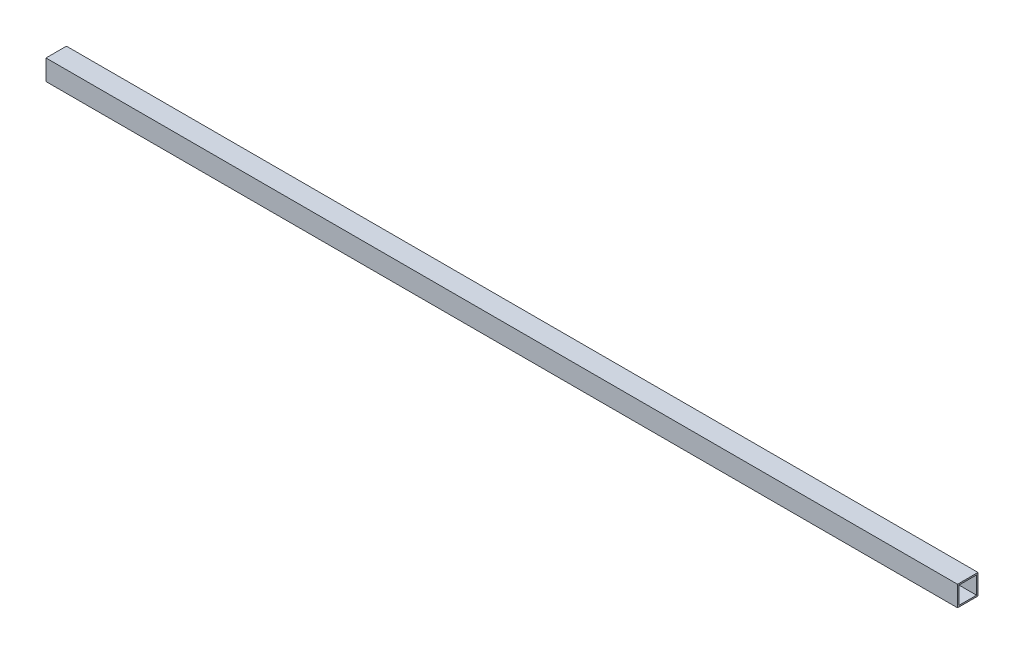
ISO-10303-21;
HEADER;
FILE_DESCRIPTION(('STEP AP214'),'2;1');
FILE_NAME('part.step','',(''),(''),'','','');
FILE_SCHEMA(('AUTOMOTIVE_DESIGN { 1 0 10303 214 1 1 1 1 }'));
ENDSEC;
DATA;
#1=APPLICATION_CONTEXT('core data for automotive mechanical design processes');
#2=APPLICATION_PROTOCOL_DEFINITION('international standard','automotive_design',2000,#1);
#3=PRODUCT_CONTEXT('',#1,'mechanical');
#4=PRODUCT('Part','Part','',(#3));
#5=PRODUCT_RELATED_PRODUCT_CATEGORY('part','',(#4));
#6=PRODUCT_DEFINITION_FORMATION('','',#4);
#7=PRODUCT_DEFINITION_CONTEXT('part definition',#1,'design');
#8=PRODUCT_DEFINITION('design','',#6,#7);
#9=PRODUCT_DEFINITION_SHAPE('','',#8);
#10=(LENGTH_UNIT() NAMED_UNIT(*) SI_UNIT(.MILLI.,.METRE.));
#11=(NAMED_UNIT(*) PLANE_ANGLE_UNIT() SI_UNIT($,.RADIAN.));
#12=(NAMED_UNIT(*) SI_UNIT($,.STERADIAN.) SOLID_ANGLE_UNIT());
#13=UNCERTAINTY_MEASURE_WITH_UNIT(LENGTH_MEASURE(1.E-05),#10,'distance_accuracy_value','');
#14=(GEOMETRIC_REPRESENTATION_CONTEXT(3) GLOBAL_UNCERTAINTY_ASSIGNED_CONTEXT((#13)) GLOBAL_UNIT_ASSIGNED_CONTEXT((#10,
#11,#12)) REPRESENTATION_CONTEXT('',''));
#15=CARTESIAN_POINT('',(0.,0.,0.));
#16=DIRECTION('',(0.,0.,1.));
#17=DIRECTION('',(1.,0.,0.));
#18=AXIS2_PLACEMENT_3D('',#15,#16,#17);
#19=CARTESIAN_POINT('',(990.6,0.,0.));
#20=DIRECTION('',(1.,0.,0.));
#21=DIRECTION('',(0.,0.,-1.));
#22=AXIS2_PLACEMENT_3D('',#19,#20,#21);
#23=PLANE('',#22);
#24=DIRECTION('',(0.,-1.,0.));
#25=VECTOR('',#24,1.);
#26=CARTESIAN_POINT('',(990.6,44.45,0.));
#27=LINE('',#26,#25);
#28=CARTESIAN_POINT('',(990.6,44.45,0.));
#29=VERTEX_POINT('',#28);
#30=CARTESIAN_POINT('',(990.6,0.,0.));
#31=VERTEX_POINT('',#30);
#32=EDGE_CURVE('E135',#29,#31,#27,.T.);
#33=ORIENTED_EDGE('',*,*,#32,.T.);
#34=DIRECTION('',(0.,0.,-1.));
#35=VECTOR('',#34,1.);
#36=CARTESIAN_POINT('',(990.6,0.,0.));
#37=LINE('',#36,#35);
#38=CARTESIAN_POINT('',(990.6,0.,-44.45));
#39=VERTEX_POINT('',#38);
#40=EDGE_CURVE('E138',#31,#39,#37,.T.);
#41=ORIENTED_EDGE('',*,*,#40,.T.);
#42=DIRECTION('',(0.,1.,0.));
#43=VECTOR('',#42,1.);
#44=CARTESIAN_POINT('',(990.6,0.,-44.45));
#45=LINE('',#44,#43);
#46=CARTESIAN_POINT('',(990.6,44.45,-44.45));
#47=VERTEX_POINT('',#46);
#48=EDGE_CURVE('E141',#39,#47,#45,.T.);
#49=ORIENTED_EDGE('',*,*,#48,.T.);
#50=DIRECTION('',(0.,0.,1.));
#51=VECTOR('',#50,1.);
#52=CARTESIAN_POINT('',(990.6,44.45,-44.45));
#53=LINE('',#52,#51);
#54=EDGE_CURVE('E143',#47,#29,#53,.T.);
#55=ORIENTED_EDGE('',*,*,#54,.T.);
#56=EDGE_LOOP('',(#33,#41,#49,#55));
#57=FACE_BOUND('',#56,.T.);
#58=DIRECTION('',(0.,0.,1.));
#59=VECTOR('',#58,1.);
#60=CARTESIAN_POINT('',(990.6,41.275,-41.275));
#61=LINE('',#60,#59);
#62=CARTESIAN_POINT('',(990.6,41.275,-41.275));
#63=VERTEX_POINT('',#62);
#64=CARTESIAN_POINT('',(990.6,41.275,-3.175));
#65=VERTEX_POINT('',#64);
#66=EDGE_CURVE('E107',#63,#65,#61,.T.);
#67=ORIENTED_EDGE('',*,*,#66,.F.);
#68=DIRECTION('',(0.,1.,0.));
#69=VECTOR('',#68,1.);
#70=CARTESIAN_POINT('',(990.6,3.175,-41.275));
#71=LINE('',#70,#69);
#72=CARTESIAN_POINT('',(990.6,3.175,-41.275));
#73=VERTEX_POINT('',#72);
#74=EDGE_CURVE('E99',#73,#63,#71,.T.);
#75=ORIENTED_EDGE('',*,*,#74,.F.);
#76=DIRECTION('',(0.,0.,-1.));
#77=VECTOR('',#76,1.);
#78=CARTESIAN_POINT('',(990.6,3.175,-3.17500000000001));
#79=LINE('',#78,#77);
#80=CARTESIAN_POINT('',(990.6,3.175,-3.17500000000001));
#81=VERTEX_POINT('',#80);
#82=EDGE_CURVE('E121',#81,#73,#79,.T.);
#83=ORIENTED_EDGE('',*,*,#82,.F.);
#84=DIRECTION('',(0.,-1.,0.));
#85=VECTOR('',#84,1.);
#86=CARTESIAN_POINT('',(990.6,41.275,-3.175));
#87=LINE('',#86,#85);
#88=EDGE_CURVE('E119',#65,#81,#87,.T.);
#89=ORIENTED_EDGE('',*,*,#88,.F.);
#90=EDGE_LOOP('',(#67,#75,#83,#89));
#91=FACE_BOUND('',#90,.T.);
#92=ADVANCED_FACE('F34',(#57,#91),#23,.T.);
#93=CARTESIAN_POINT('',(-990.6,0.,0.));
#94=DIRECTION('',(1.,0.,0.));
#95=DIRECTION('',(0.,0.,-1.));
#96=AXIS2_PLACEMENT_3D('',#93,#94,#95);
#97=PLANE('',#96);
#98=DIRECTION('',(0.,-1.,0.));
#99=VECTOR('',#98,1.);
#100=CARTESIAN_POINT('',(-990.6,44.45,0.));
#101=LINE('',#100,#99);
#102=CARTESIAN_POINT('',(-990.6,44.45,0.));
#103=VERTEX_POINT('',#102);
#104=CARTESIAN_POINT('',(-990.6,0.,0.));
#105=VERTEX_POINT('',#104);
#106=EDGE_CURVE('E115',#103,#105,#101,.T.);
#107=ORIENTED_EDGE('',*,*,#106,.F.);
#108=DIRECTION('',(0.,0.,1.));
#109=VECTOR('',#108,1.);
#110=CARTESIAN_POINT('',(-990.6,44.45,-44.45));
#111=LINE('',#110,#109);
#112=CARTESIAN_POINT('',(-990.6,44.45,-44.45));
#113=VERTEX_POINT('',#112);
#114=EDGE_CURVE('E139',#113,#103,#111,.T.);
#115=ORIENTED_EDGE('',*,*,#114,.F.);
#116=DIRECTION('',(0.,1.,0.));
#117=VECTOR('',#116,1.);
#118=CARTESIAN_POINT('',(-990.6,0.,-44.45));
#119=LINE('',#118,#117);
#120=CARTESIAN_POINT('',(-990.6,0.,-44.45));
#121=VERTEX_POINT('',#120);
#122=EDGE_CURVE('E150',#121,#113,#119,.T.);
#123=ORIENTED_EDGE('',*,*,#122,.F.);
#124=DIRECTION('',(0.,0.,-1.));
#125=VECTOR('',#124,1.);
#126=CARTESIAN_POINT('',(-990.6,0.,0.));
#127=LINE('',#126,#125);
#128=EDGE_CURVE('E148',#105,#121,#127,.T.);
#129=ORIENTED_EDGE('',*,*,#128,.F.);
#130=EDGE_LOOP('',(#107,#115,#123,#129));
#131=FACE_BOUND('',#130,.T.);
#132=DIRECTION('',(0.,1.,0.));
#133=VECTOR('',#132,1.);
#134=CARTESIAN_POINT('',(-990.6,3.175,-41.275));
#135=LINE('',#134,#133);
#136=CARTESIAN_POINT('',(-990.6,3.175,-41.275));
#137=VERTEX_POINT('',#136);
#138=CARTESIAN_POINT('',(-990.6,41.275,-41.275));
#139=VERTEX_POINT('',#138);
#140=EDGE_CURVE('E57',#137,#139,#135,.T.);
#141=ORIENTED_EDGE('',*,*,#140,.T.);
#142=DIRECTION('',(0.,0.,1.));
#143=VECTOR('',#142,1.);
#144=CARTESIAN_POINT('',(-990.6,41.275,-41.275));
#145=LINE('',#144,#143);
#146=CARTESIAN_POINT('',(-990.6,41.275,-3.175));
#147=VERTEX_POINT('',#146);
#148=EDGE_CURVE('E114',#139,#147,#145,.T.);
#149=ORIENTED_EDGE('',*,*,#148,.T.);
#150=DIRECTION('',(0.,-1.,0.));
#151=VECTOR('',#150,1.);
#152=CARTESIAN_POINT('',(-990.6,41.275,-3.175));
#153=LINE('',#152,#151);
#154=CARTESIAN_POINT('',(-990.6,3.175,-3.17500000000001));
#155=VERTEX_POINT('',#154);
#156=EDGE_CURVE('E127',#147,#155,#153,.T.);
#157=ORIENTED_EDGE('',*,*,#156,.T.);
#158=DIRECTION('',(0.,0.,-1.));
#159=VECTOR('',#158,1.);
#160=CARTESIAN_POINT('',(-990.6,3.175,-3.17500000000001));
#161=LINE('',#160,#159);
#162=EDGE_CURVE('E108',#155,#137,#161,.T.);
#163=ORIENTED_EDGE('',*,*,#162,.T.);
#164=EDGE_LOOP('',(#141,#149,#157,#163));
#165=FACE_BOUND('',#164,.T.);
#166=ADVANCED_FACE('F168',(#131,#165),#97,.F.);
#167=CARTESIAN_POINT('',(990.6,44.45,0.));
#168=DIRECTION('',(0.,0.,-1.));
#169=DIRECTION('',(0.,1.,0.));
#170=AXIS2_PLACEMENT_3D('',#167,#168,#169);
#171=PLANE('',#170);
#172=ORIENTED_EDGE('',*,*,#106,.T.);
#173=DIRECTION('',(-1.,0.,0.));
#174=VECTOR('',#173,1.);
#175=CARTESIAN_POINT('',(990.6,0.,0.));
#176=LINE('',#175,#174);
#177=EDGE_CURVE('E11',#31,#105,#176,.T.);
#178=ORIENTED_EDGE('',*,*,#177,.F.);
#179=ORIENTED_EDGE('',*,*,#32,.F.);
#180=DIRECTION('',(-1.,0.,0.));
#181=VECTOR('',#180,1.);
#182=CARTESIAN_POINT('',(990.6,44.45,0.));
#183=LINE('',#182,#181);
#184=EDGE_CURVE('E145',#29,#103,#183,.T.);
#185=ORIENTED_EDGE('',*,*,#184,.T.);
#186=EDGE_LOOP('',(#172,#178,#179,#185));
#187=FACE_BOUND('',#186,.T.);
#188=ADVANCED_FACE('F36',(#187),#171,.F.);
#189=CARTESIAN_POINT('',(990.6,0.,0.));
#190=DIRECTION('',(0.,1.,0.));
#191=DIRECTION('',(0.,0.,1.));
#192=AXIS2_PLACEMENT_3D('',#189,#190,#191);
#193=PLANE('',#192);
#194=ORIENTED_EDGE('',*,*,#128,.T.);
#195=DIRECTION('',(-1.,0.,0.));
#196=VECTOR('',#195,1.);
#197=CARTESIAN_POINT('',(990.6,0.,-44.45));
#198=LINE('',#197,#196);
#199=EDGE_CURVE('E42',#39,#121,#198,.T.);
#200=ORIENTED_EDGE('',*,*,#199,.F.);
#201=ORIENTED_EDGE('',*,*,#40,.F.);
#202=ORIENTED_EDGE('',*,*,#177,.T.);
#203=EDGE_LOOP('',(#194,#200,#201,#202));
#204=FACE_BOUND('',#203,.T.);
#205=ADVANCED_FACE('F178',(#204),#193,.F.);
#206=CARTESIAN_POINT('',(990.6,0.,-44.45));
#207=DIRECTION('',(0.,0.,1.));
#208=DIRECTION('',(0.,-1.,0.));
#209=AXIS2_PLACEMENT_3D('',#206,#207,#208);
#210=PLANE('',#209);
#211=ORIENTED_EDGE('',*,*,#122,.T.);
#212=DIRECTION('',(-1.,0.,0.));
#213=VECTOR('',#212,1.);
#214=CARTESIAN_POINT('',(990.6,44.45,-44.45));
#215=LINE('',#214,#213);
#216=EDGE_CURVE('E155',#47,#113,#215,.T.);
#217=ORIENTED_EDGE('',*,*,#216,.F.);
#218=ORIENTED_EDGE('',*,*,#48,.F.);
#219=ORIENTED_EDGE('',*,*,#199,.T.);
#220=EDGE_LOOP('',(#211,#217,#218,#219));
#221=FACE_BOUND('',#220,.T.);
#222=ADVANCED_FACE('F162',(#221),#210,.F.);
#223=CARTESIAN_POINT('',(990.6,44.45,-44.45));
#224=DIRECTION('',(0.,-1.,0.));
#225=DIRECTION('',(0.,0.,-1.));
#226=AXIS2_PLACEMENT_3D('',#223,#224,#225);
#227=PLANE('',#226);
#228=ORIENTED_EDGE('',*,*,#114,.T.);
#229=ORIENTED_EDGE('',*,*,#184,.F.);
#230=ORIENTED_EDGE('',*,*,#54,.F.);
#231=ORIENTED_EDGE('',*,*,#216,.T.);
#232=EDGE_LOOP('',(#228,#229,#230,#231));
#233=FACE_BOUND('',#232,.T.);
#234=ADVANCED_FACE('F172',(#233),#227,.F.);
#235=CARTESIAN_POINT('',(990.6,3.175,-41.275));
#236=DIRECTION('',(0.,0.,1.));
#237=DIRECTION('',(0.,-1.,0.));
#238=AXIS2_PLACEMENT_3D('',#235,#236,#237);
#239=PLANE('',#238);
#240=ORIENTED_EDGE('',*,*,#140,.F.);
#241=DIRECTION('',(-1.,0.,0.));
#242=VECTOR('',#241,1.);
#243=CARTESIAN_POINT('',(990.6,3.175,-41.275));
#244=LINE('',#243,#242);
#245=EDGE_CURVE('E103',#73,#137,#244,.T.);
#246=ORIENTED_EDGE('',*,*,#245,.F.);
#247=ORIENTED_EDGE('',*,*,#74,.T.);
#248=DIRECTION('',(-1.,0.,0.));
#249=VECTOR('',#248,1.);
#250=CARTESIAN_POINT('',(990.6,41.275,-41.275));
#251=LINE('',#250,#249);
#252=EDGE_CURVE('E102',#63,#139,#251,.T.);
#253=ORIENTED_EDGE('',*,*,#252,.T.);
#254=EDGE_LOOP('',(#240,#246,#247,#253));
#255=FACE_BOUND('',#254,.T.);
#256=ADVANCED_FACE('F101',(#255),#239,.T.);
#257=CARTESIAN_POINT('',(990.6,41.275,-41.275));
#258=DIRECTION('',(0.,-1.,0.));
#259=DIRECTION('',(0.,0.,-1.));
#260=AXIS2_PLACEMENT_3D('',#257,#258,#259);
#261=PLANE('',#260);
#262=ORIENTED_EDGE('',*,*,#148,.F.);
#263=ORIENTED_EDGE('',*,*,#252,.F.);
#264=ORIENTED_EDGE('',*,*,#66,.T.);
#265=DIRECTION('',(-1.,0.,0.));
#266=VECTOR('',#265,1.);
#267=CARTESIAN_POINT('',(990.6,41.275,-3.175));
#268=LINE('',#267,#266);
#269=EDGE_CURVE('E116',#65,#147,#268,.T.);
#270=ORIENTED_EDGE('',*,*,#269,.T.);
#271=EDGE_LOOP('',(#262,#263,#264,#270));
#272=FACE_BOUND('',#271,.T.);
#273=ADVANCED_FACE('F111',(#272),#261,.T.);
#274=CARTESIAN_POINT('',(990.6,41.275,-3.175));
#275=DIRECTION('',(0.,0.,-1.));
#276=DIRECTION('',(0.,1.,0.));
#277=AXIS2_PLACEMENT_3D('',#274,#275,#276);
#278=PLANE('',#277);
#279=ORIENTED_EDGE('',*,*,#156,.F.);
#280=ORIENTED_EDGE('',*,*,#269,.F.);
#281=ORIENTED_EDGE('',*,*,#88,.T.);
#282=DIRECTION('',(-1.,0.,0.));
#283=VECTOR('',#282,1.);
#284=CARTESIAN_POINT('',(990.6,3.175,-3.17500000000001));
#285=LINE('',#284,#283);
#286=EDGE_CURVE('E49',#81,#155,#285,.T.);
#287=ORIENTED_EDGE('',*,*,#286,.T.);
#288=EDGE_LOOP('',(#279,#280,#281,#287));
#289=FACE_BOUND('',#288,.T.);
#290=ADVANCED_FACE('F201',(#289),#278,.T.);
#291=CARTESIAN_POINT('',(990.6,3.175,-3.17500000000001));
#292=DIRECTION('',(0.,1.,0.));
#293=DIRECTION('',(0.,0.,1.));
#294=AXIS2_PLACEMENT_3D('',#291,#292,#293);
#295=PLANE('',#294);
#296=ORIENTED_EDGE('',*,*,#162,.F.);
#297=ORIENTED_EDGE('',*,*,#286,.F.);
#298=ORIENTED_EDGE('',*,*,#82,.T.);
#299=ORIENTED_EDGE('',*,*,#245,.T.);
#300=EDGE_LOOP('',(#296,#297,#298,#299));
#301=FACE_BOUND('',#300,.T.);
#302=ADVANCED_FACE('F205',(#301),#295,.T.);
#303=CLOSED_SHELL('',(#92,#166,#188,#205,#222,#234,#256,#273,#290,#302));
#304=MANIFOLD_SOLID_BREP('B2',#303);
#305=ADVANCED_BREP_SHAPE_REPRESENTATION('',(#18,#304),#14);
#306=SHAPE_DEFINITION_REPRESENTATION(#9,#305);
ENDSEC;
END-ISO-10303-21;
